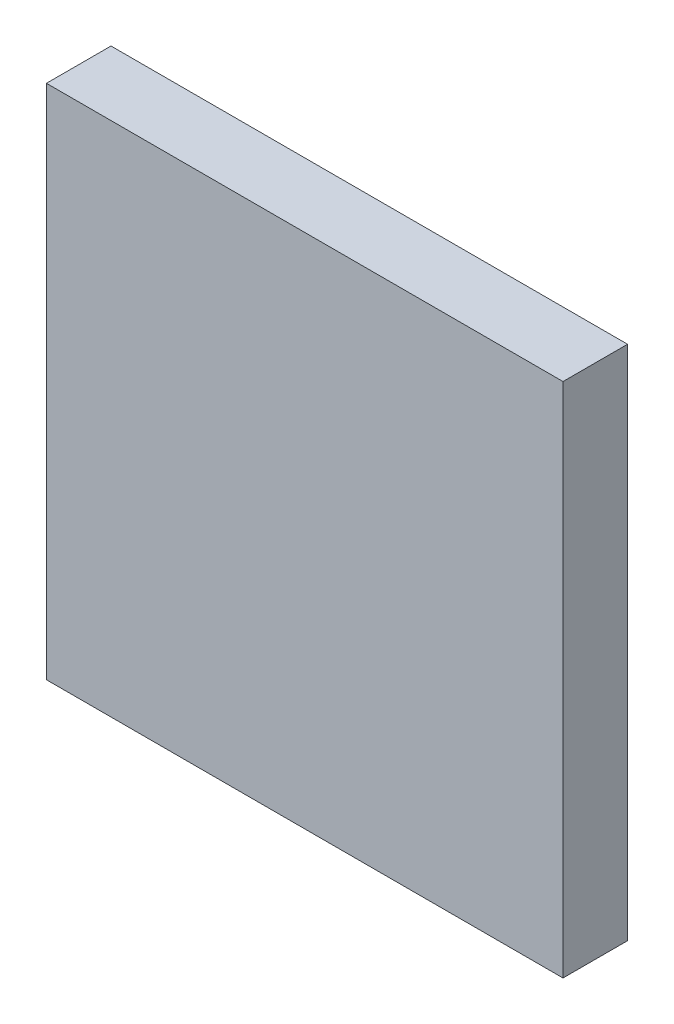
ISO-10303-21;
HEADER;
FILE_DESCRIPTION(('STEP AP214'),'2;1');
FILE_NAME('part.step','',(''),(''),'','','');
FILE_SCHEMA(('AUTOMOTIVE_DESIGN { 1 0 10303 214 1 1 1 1 }'));
ENDSEC;
DATA;
#1=APPLICATION_CONTEXT('core data for automotive mechanical design processes');
#2=APPLICATION_PROTOCOL_DEFINITION('international standard','automotive_design',2000,#1);
#3=PRODUCT_CONTEXT('',#1,'mechanical');
#4=PRODUCT('Part','Part','',(#3));
#5=PRODUCT_RELATED_PRODUCT_CATEGORY('part','',(#4));
#6=PRODUCT_DEFINITION_FORMATION('','',#4);
#7=PRODUCT_DEFINITION_CONTEXT('part definition',#1,'design');
#8=PRODUCT_DEFINITION('design','',#6,#7);
#9=PRODUCT_DEFINITION_SHAPE('','',#8);
#10=(LENGTH_UNIT() NAMED_UNIT(*) SI_UNIT(.MILLI.,.METRE.));
#11=(NAMED_UNIT(*) PLANE_ANGLE_UNIT() SI_UNIT($,.RADIAN.));
#12=(NAMED_UNIT(*) SI_UNIT($,.STERADIAN.) SOLID_ANGLE_UNIT());
#13=UNCERTAINTY_MEASURE_WITH_UNIT(LENGTH_MEASURE(1.E-05),#10,'distance_accuracy_value','');
#14=(GEOMETRIC_REPRESENTATION_CONTEXT(3) GLOBAL_UNCERTAINTY_ASSIGNED_CONTEXT((#13)) GLOBAL_UNIT_ASSIGNED_CONTEXT((#10,
#11,#12)) REPRESENTATION_CONTEXT('',''));
#15=CARTESIAN_POINT('',(0.,0.,0.));
#16=DIRECTION('',(0.,0.,1.));
#17=DIRECTION('',(1.,0.,0.));
#18=AXIS2_PLACEMENT_3D('',#15,#16,#17);
#19=CARTESIAN_POINT('',(3.99999962,-3.99999962,1.00000054));
#20=DIRECTION('',(0.,0.,-1.));
#21=DIRECTION('',(0.,-1.,0.));
#22=AXIS2_PLACEMENT_3D('',#19,#20,#21);
#23=PLANE('',#22);
#24=DIRECTION('',(0.,1.,0.));
#25=VECTOR('',#24,1.);
#26=CARTESIAN_POINT('',(3.99999962,-3.99999962,1.00000054));
#27=LINE('',#26,#25);
#28=CARTESIAN_POINT('',(3.99999962,-3.99999962,1.00000054));
#29=VERTEX_POINT('',#28);
#30=CARTESIAN_POINT('',(3.99999962,3.99999962,1.00000054));
#31=VERTEX_POINT('',#30);
#32=EDGE_CURVE('E82',#29,#31,#27,.T.);
#33=ORIENTED_EDGE('',*,*,#32,.T.);
#34=DIRECTION('',(-1.,0.,0.));
#35=VECTOR('',#34,1.);
#36=CARTESIAN_POINT('',(3.99999962,3.99999962,1.00000054));
#37=LINE('',#36,#35);
#38=CARTESIAN_POINT('',(-3.99999962,3.99999962,1.00000054));
#39=VERTEX_POINT('',#38);
#40=EDGE_CURVE('E80',#31,#39,#37,.T.);
#41=ORIENTED_EDGE('',*,*,#40,.T.);
#42=DIRECTION('',(0.,-1.,0.));
#43=VECTOR('',#42,1.);
#44=CARTESIAN_POINT('',(-3.99999962,3.99999962,1.00000054));
#45=LINE('',#44,#43);
#46=CARTESIAN_POINT('',(-3.99999962,-3.99999962,1.00000054));
#47=VERTEX_POINT('',#46);
#48=EDGE_CURVE('E68',#39,#47,#45,.T.);
#49=ORIENTED_EDGE('',*,*,#48,.T.);
#50=DIRECTION('',(1.,0.,0.));
#51=VECTOR('',#50,1.);
#52=CARTESIAN_POINT('',(-3.99999962,-3.99999962,1.00000054));
#53=LINE('',#52,#51);
#54=EDGE_CURVE('E11',#47,#29,#53,.T.);
#55=ORIENTED_EDGE('',*,*,#54,.T.);
#56=EDGE_LOOP('',(#33,#41,#49,#55));
#57=FACE_BOUND('',#56,.T.);
#58=ADVANCED_FACE('F16',(#57),#23,.F.);
#59=CARTESIAN_POINT('',(3.99999962,-3.99999962,0.));
#60=DIRECTION('',(0.,0.,-1.));
#61=DIRECTION('',(0.,-1.,0.));
#62=AXIS2_PLACEMENT_3D('',#59,#60,#61);
#63=PLANE('',#62);
#64=DIRECTION('',(1.,0.,0.));
#65=VECTOR('',#64,1.);
#66=CARTESIAN_POINT('',(-3.99999962,-3.99999962,0.));
#67=LINE('',#66,#65);
#68=CARTESIAN_POINT('',(-3.99999962,-3.99999962,0.));
#69=VERTEX_POINT('',#68);
#70=CARTESIAN_POINT('',(3.99999962,-3.99999962,0.));
#71=VERTEX_POINT('',#70);
#72=EDGE_CURVE('E20',#69,#71,#67,.T.);
#73=ORIENTED_EDGE('',*,*,#72,.F.);
#74=DIRECTION('',(0.,-1.,0.));
#75=VECTOR('',#74,1.);
#76=CARTESIAN_POINT('',(-3.99999962,3.99999962,0.));
#77=LINE('',#76,#75);
#78=CARTESIAN_POINT('',(-3.99999962,3.99999962,0.));
#79=VERTEX_POINT('',#78);
#80=EDGE_CURVE('E61',#79,#69,#77,.T.);
#81=ORIENTED_EDGE('',*,*,#80,.F.);
#82=DIRECTION('',(-1.,0.,0.));
#83=VECTOR('',#82,1.);
#84=CARTESIAN_POINT('',(3.99999962,3.99999962,0.));
#85=LINE('',#84,#83);
#86=CARTESIAN_POINT('',(3.99999962,3.99999962,0.));
#87=VERTEX_POINT('',#86);
#88=EDGE_CURVE('E88',#87,#79,#85,.T.);
#89=ORIENTED_EDGE('',*,*,#88,.F.);
#90=DIRECTION('',(0.,1.,0.));
#91=VECTOR('',#90,1.);
#92=CARTESIAN_POINT('',(3.99999962,-3.99999962,0.));
#93=LINE('',#92,#91);
#94=EDGE_CURVE('E99',#71,#87,#93,.T.);
#95=ORIENTED_EDGE('',*,*,#94,.F.);
#96=EDGE_LOOP('',(#73,#81,#89,#95));
#97=FACE_BOUND('',#96,.T.);
#98=ADVANCED_FACE('F119',(#97),#63,.T.);
#99=CARTESIAN_POINT('',(-3.99999962,-3.99999962,0.));
#100=DIRECTION('',(0.,1.,0.));
#101=DIRECTION('',(1.,0.,0.));
#102=AXIS2_PLACEMENT_3D('',#99,#100,#101);
#103=PLANE('',#102);
#104=ORIENTED_EDGE('',*,*,#72,.T.);
#105=DIRECTION('',(0.,0.,1.));
#106=VECTOR('',#105,1.);
#107=CARTESIAN_POINT('',(3.99999962,-3.99999962,0.));
#108=LINE('',#107,#106);
#109=EDGE_CURVE('E95',#71,#29,#108,.T.);
#110=ORIENTED_EDGE('',*,*,#109,.T.);
#111=ORIENTED_EDGE('',*,*,#54,.F.);
#112=DIRECTION('',(0.,0.,1.));
#113=VECTOR('',#112,1.);
#114=CARTESIAN_POINT('',(-3.99999962,-3.99999962,0.));
#115=LINE('',#114,#113);
#116=EDGE_CURVE('E74',#69,#47,#115,.T.);
#117=ORIENTED_EDGE('',*,*,#116,.F.);
#118=EDGE_LOOP('',(#104,#110,#111,#117));
#119=FACE_BOUND('',#118,.T.);
#120=ADVANCED_FACE('F112',(#119),#103,.F.);
#121=CARTESIAN_POINT('',(-3.99999962,3.99999962,0.));
#122=DIRECTION('',(1.,0.,0.));
#123=DIRECTION('',(0.,1.,0.));
#124=AXIS2_PLACEMENT_3D('',#121,#122,#123);
#125=PLANE('',#124);
#126=ORIENTED_EDGE('',*,*,#80,.T.);
#127=ORIENTED_EDGE('',*,*,#116,.T.);
#128=ORIENTED_EDGE('',*,*,#48,.F.);
#129=DIRECTION('',(0.,0.,1.));
#130=VECTOR('',#129,1.);
#131=CARTESIAN_POINT('',(-3.99999962,3.99999962,0.));
#132=LINE('',#131,#130);
#133=EDGE_CURVE('E72',#79,#39,#132,.T.);
#134=ORIENTED_EDGE('',*,*,#133,.F.);
#135=EDGE_LOOP('',(#126,#127,#128,#134));
#136=FACE_BOUND('',#135,.T.);
#137=ADVANCED_FACE('F70',(#136),#125,.F.);
#138=CARTESIAN_POINT('',(3.99999962,3.99999962,0.));
#139=DIRECTION('',(0.,-1.,0.));
#140=DIRECTION('',(0.,0.,-1.));
#141=AXIS2_PLACEMENT_3D('',#138,#139,#140);
#142=PLANE('',#141);
#143=ORIENTED_EDGE('',*,*,#88,.T.);
#144=ORIENTED_EDGE('',*,*,#133,.T.);
#145=ORIENTED_EDGE('',*,*,#40,.F.);
#146=DIRECTION('',(0.,0.,1.));
#147=VECTOR('',#146,1.);
#148=CARTESIAN_POINT('',(3.99999962,3.99999962,0.));
#149=LINE('',#148,#147);
#150=EDGE_CURVE('E104',#87,#31,#149,.T.);
#151=ORIENTED_EDGE('',*,*,#150,.F.);
#152=EDGE_LOOP('',(#143,#144,#145,#151));
#153=FACE_BOUND('',#152,.T.);
#154=ADVANCED_FACE('F87',(#153),#142,.F.);
#155=CARTESIAN_POINT('',(3.99999962,-3.99999962,0.));
#156=DIRECTION('',(-1.,0.,0.));
#157=DIRECTION('',(0.,0.,1.));
#158=AXIS2_PLACEMENT_3D('',#155,#156,#157);
#159=PLANE('',#158);
#160=ORIENTED_EDGE('',*,*,#94,.T.);
#161=ORIENTED_EDGE('',*,*,#150,.T.);
#162=ORIENTED_EDGE('',*,*,#32,.F.);
#163=ORIENTED_EDGE('',*,*,#109,.F.);
#164=EDGE_LOOP('',(#160,#161,#162,#163));
#165=FACE_BOUND('',#164,.T.);
#166=ADVANCED_FACE('F18',(#165),#159,.F.);
#167=CLOSED_SHELL('',(#58,#98,#120,#137,#154,#166));
#168=MANIFOLD_SOLID_BREP('B1',#167);
#169=ADVANCED_BREP_SHAPE_REPRESENTATION('',(#18,#168),#14);
#170=SHAPE_DEFINITION_REPRESENTATION(#9,#169);
ENDSEC;
END-ISO-10303-21;
